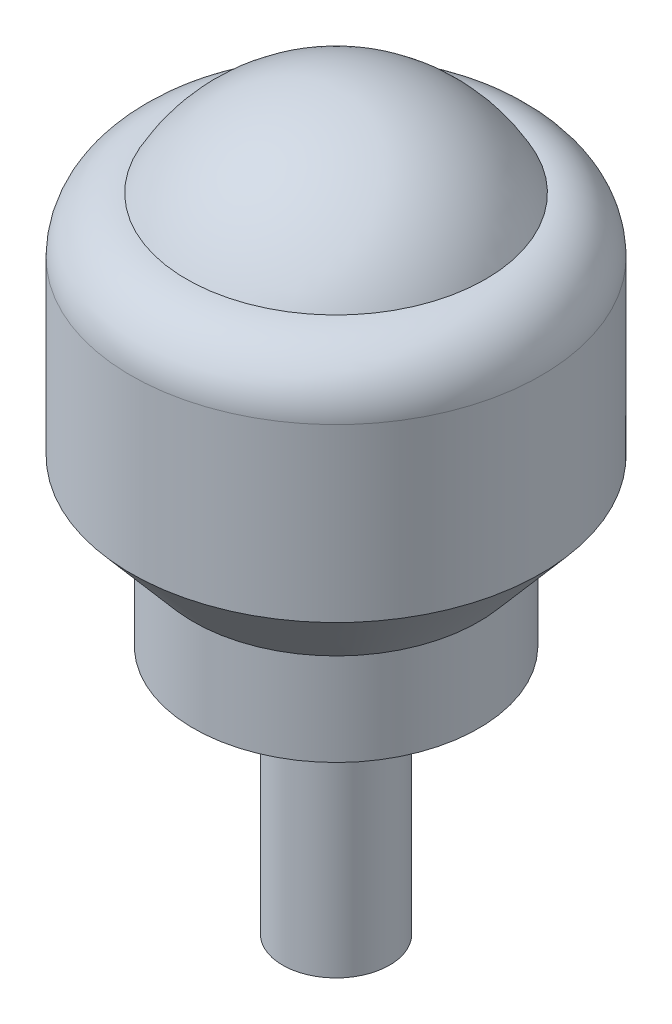
ISO-10303-21;
HEADER;
FILE_DESCRIPTION(('STEP AP214'),'2;1');
FILE_NAME('part.step','',(''),(''),'','','');
FILE_SCHEMA(('AUTOMOTIVE_DESIGN { 1 0 10303 214 1 1 1 1 }'));
ENDSEC;
DATA;
#1=APPLICATION_CONTEXT('core data for automotive mechanical design processes');
#2=APPLICATION_PROTOCOL_DEFINITION('international standard','automotive_design',2000,#1);
#3=PRODUCT_CONTEXT('',#1,'mechanical');
#4=PRODUCT('Part','Part','',(#3));
#5=PRODUCT_RELATED_PRODUCT_CATEGORY('part','',(#4));
#6=PRODUCT_DEFINITION_FORMATION('','',#4);
#7=PRODUCT_DEFINITION_CONTEXT('part definition',#1,'design');
#8=PRODUCT_DEFINITION('design','',#6,#7);
#9=PRODUCT_DEFINITION_SHAPE('','',#8);
#10=(LENGTH_UNIT() NAMED_UNIT(*) SI_UNIT(.MILLI.,.METRE.));
#11=(NAMED_UNIT(*) PLANE_ANGLE_UNIT() SI_UNIT($,.RADIAN.));
#12=(NAMED_UNIT(*) SI_UNIT($,.STERADIAN.) SOLID_ANGLE_UNIT());
#13=UNCERTAINTY_MEASURE_WITH_UNIT(LENGTH_MEASURE(1.E-05),#10,'distance_accuracy_value','');
#14=(GEOMETRIC_REPRESENTATION_CONTEXT(3) GLOBAL_UNCERTAINTY_ASSIGNED_CONTEXT((#13)) GLOBAL_UNIT_ASSIGNED_CONTEXT((#10,
#11,#12)) REPRESENTATION_CONTEXT('',''));
#15=CARTESIAN_POINT('',(0.,0.,0.));
#16=DIRECTION('',(0.,0.,1.));
#17=DIRECTION('',(1.,0.,0.));
#18=AXIS2_PLACEMENT_3D('',#15,#16,#17);
#19=CARTESIAN_POINT('',(0.,0.,0.));
#20=DIRECTION('',(0.,1.,0.));
#21=DIRECTION('',(1.,0.,0.));
#22=AXIS2_PLACEMENT_3D('',#19,#20,#21);
#23=SPHERICAL_SURFACE('',#22,9.525);
#24=CARTESIAN_POINT('',(0.,4.525,0.));
#25=DIRECTION('',(0.,1.,0.));
#26=DIRECTION('',(-1.,0.,0.));
#27=AXIS2_PLACEMENT_3D('',#24,#25,#26);
#28=CIRCLE('',#27,8.3815273071201);
#29=CARTESIAN_POINT('',(-8.3815273071201,4.525,0.));
#30=VERTEX_POINT('',#29);
#31=EDGE_CURVE('E10',#30,#30,#28,.T.);
#32=ORIENTED_EDGE('',*,*,#31,.T.);
#33=EDGE_LOOP('',(#32));
#34=FACE_BOUND('',#33,.T.);
#35=ADVANCED_FACE('F31',(#34),#23,.T.);
#36=CARTESIAN_POINT('',(0.,1.40652730712011,0.));
#37=DIRECTION('',(0.,1.,0.));
#38=DIRECTION('',(-1.,0.,0.));
#39=AXIS2_PLACEMENT_3D('',#36,#37,#38);
#40=TOROIDAL_SURFACE('',#39,8.3815273071201,3.1184726928799);
#41=ORIENTED_EDGE('',*,*,#31,.F.);
#42=EDGE_LOOP('',(#41));
#43=FACE_BOUND('',#42,.T.);
#44=CARTESIAN_POINT('',(0.,1.4065273071201,0.));
#45=DIRECTION('',(0.,1.,0.));
#46=DIRECTION('',(-1.,0.,0.));
#47=AXIS2_PLACEMENT_3D('',#44,#45,#46);
#48=CIRCLE('',#47,11.5);
#49=CARTESIAN_POINT('',(-11.5,1.4065273071201,0.));
#50=VERTEX_POINT('',#49);
#51=EDGE_CURVE('E37',#50,#50,#48,.T.);
#52=ORIENTED_EDGE('',*,*,#51,.T.);
#53=EDGE_LOOP('',(#52));
#54=FACE_BOUND('',#53,.T.);
#55=ADVANCED_FACE('F72',(#43,#54),#40,.T.);
#56=CARTESIAN_POINT('',(0.,9.525,0.));
#57=DIRECTION('',(0.,1.,0.));
#58=DIRECTION('',(-1.,0.,0.));
#59=AXIS2_PLACEMENT_3D('',#56,#57,#58);
#60=CYLINDRICAL_SURFACE('',#59,11.5);
#61=ORIENTED_EDGE('',*,*,#51,.F.);
#62=EDGE_LOOP('',(#61));
#63=FACE_BOUND('',#62,.T.);
#64=CARTESIAN_POINT('',(0.,-8.2067117749088,0.));
#65=DIRECTION('',(0.,1.,0.));
#66=DIRECTION('',(-1.,0.,0.));
#67=AXIS2_PLACEMENT_3D('',#64,#65,#66);
#68=CIRCLE('',#67,11.5);
#69=CARTESIAN_POINT('',(-11.5,-8.2067117749088,0.));
#70=VERTEX_POINT('',#69);
#71=EDGE_CURVE('E41',#70,#70,#68,.T.);
#72=ORIENTED_EDGE('',*,*,#71,.T.);
#73=EDGE_LOOP('',(#72));
#74=FACE_BOUND('',#73,.T.);
#75=ADVANCED_FACE('F76',(#63,#74),#60,.T.);
#76=CARTESIAN_POINT('',(0.,-12.3013816529149,0.));
#77=DIRECTION('',(0.,1.,0.));
#78=DIRECTION('',(-1.,0.,0.));
#79=AXIS2_PLACEMENT_3D('',#76,#77,#78);
#80=CONICAL_SURFACE('',#79,8.,0.707256647834782);
#81=ORIENTED_EDGE('',*,*,#71,.F.);
#82=EDGE_LOOP('',(#81));
#83=FACE_BOUND('',#82,.T.);
#84=CARTESIAN_POINT('',(0.,-12.3013816529149,0.));
#85=DIRECTION('',(0.,1.,0.));
#86=DIRECTION('',(-1.,0.,0.));
#87=AXIS2_PLACEMENT_3D('',#84,#85,#86);
#88=CIRCLE('',#87,8.);
#89=CARTESIAN_POINT('',(-7.99999999999999,-12.3013816529149,0.));
#90=VERTEX_POINT('',#89);
#91=EDGE_CURVE('E45',#90,#90,#88,.T.);
#92=ORIENTED_EDGE('',*,*,#91,.T.);
#93=EDGE_LOOP('',(#92));
#94=FACE_BOUND('',#93,.T.);
#95=ADVANCED_FACE('F81',(#83,#94),#80,.T.);
#96=CARTESIAN_POINT('',(0.,9.525,0.));
#97=DIRECTION('',(0.,1.,0.));
#98=DIRECTION('',(-1.,0.,0.));
#99=AXIS2_PLACEMENT_3D('',#96,#97,#98);
#100=CYLINDRICAL_SURFACE('',#99,8.);
#101=ORIENTED_EDGE('',*,*,#91,.F.);
#102=EDGE_LOOP('',(#101));
#103=FACE_BOUND('',#102,.T.);
#104=CARTESIAN_POINT('',(0.,-17.475,0.));
#105=DIRECTION('',(0.,1.,0.));
#106=DIRECTION('',(-1.,0.,0.));
#107=AXIS2_PLACEMENT_3D('',#104,#105,#106);
#108=CIRCLE('',#107,8.);
#109=CARTESIAN_POINT('',(-7.99999999999999,-17.475,0.));
#110=VERTEX_POINT('',#109);
#111=EDGE_CURVE('E50',#110,#110,#108,.T.);
#112=ORIENTED_EDGE('',*,*,#111,.T.);
#113=EDGE_LOOP('',(#112));
#114=FACE_BOUND('',#113,.T.);
#115=ADVANCED_FACE('F87',(#103,#114),#100,.T.);
#116=CARTESIAN_POINT('',(8.,-17.475,0.));
#117=DIRECTION('',(0.,1.,0.));
#118=DIRECTION('',(-1.,0.,0.));
#119=AXIS2_PLACEMENT_3D('',#116,#117,#118);
#120=PLANE('',#119);
#121=ORIENTED_EDGE('',*,*,#111,.F.);
#122=EDGE_LOOP('',(#121));
#123=FACE_BOUND('',#122,.T.);
#124=CARTESIAN_POINT('',(0.,-17.475,0.));
#125=DIRECTION('',(0.,1.,0.));
#126=DIRECTION('',(-1.,0.,0.));
#127=AXIS2_PLACEMENT_3D('',#124,#125,#126);
#128=CIRCLE('',#127,3.);
#129=CARTESIAN_POINT('',(-3.,-17.475,0.));
#130=VERTEX_POINT('',#129);
#131=EDGE_CURVE('E53',#130,#130,#128,.T.);
#132=ORIENTED_EDGE('',*,*,#131,.T.);
#133=EDGE_LOOP('',(#132));
#134=FACE_BOUND('',#133,.T.);
#135=ADVANCED_FACE('F68',(#123,#134),#120,.F.);
#136=CARTESIAN_POINT('',(0.,9.525,0.));
#137=DIRECTION('',(0.,1.,0.));
#138=DIRECTION('',(-1.,0.,0.));
#139=AXIS2_PLACEMENT_3D('',#136,#137,#138);
#140=CYLINDRICAL_SURFACE('',#139,3.);
#141=ORIENTED_EDGE('',*,*,#131,.F.);
#142=EDGE_LOOP('',(#141));
#143=FACE_BOUND('',#142,.T.);
#144=CARTESIAN_POINT('',(0.,-31.475,0.));
#145=DIRECTION('',(0.,1.,0.));
#146=DIRECTION('',(-1.,0.,0.));
#147=AXIS2_PLACEMENT_3D('',#144,#145,#146);
#148=CIRCLE('',#147,3.);
#149=CARTESIAN_POINT('',(-2.99999999999999,-31.475,0.));
#150=VERTEX_POINT('',#149);
#151=EDGE_CURVE('E56',#150,#150,#148,.T.);
#152=ORIENTED_EDGE('',*,*,#151,.T.);
#153=EDGE_LOOP('',(#152));
#154=FACE_BOUND('',#153,.T.);
#155=ADVANCED_FACE('F60',(#143,#154),#140,.T.);
#156=CARTESIAN_POINT('',(3.00000000000001,-31.475,0.));
#157=DIRECTION('',(0.,1.,0.));
#158=DIRECTION('',(-1.,0.,0.));
#159=AXIS2_PLACEMENT_3D('',#156,#157,#158);
#160=PLANE('',#159);
#161=ORIENTED_EDGE('',*,*,#151,.F.);
#162=EDGE_LOOP('',(#161));
#163=FACE_BOUND('',#162,.T.);
#164=ADVANCED_FACE('F62',(#163),#160,.F.);
#165=CLOSED_SHELL('',(#35,#55,#75,#95,#115,#135,#155,#164));
#166=MANIFOLD_SOLID_BREP('B2',#165);
#167=ADVANCED_BREP_SHAPE_REPRESENTATION('',(#18,#166),#14);
#168=SHAPE_DEFINITION_REPRESENTATION(#9,#167);
ENDSEC;
END-ISO-10303-21;
